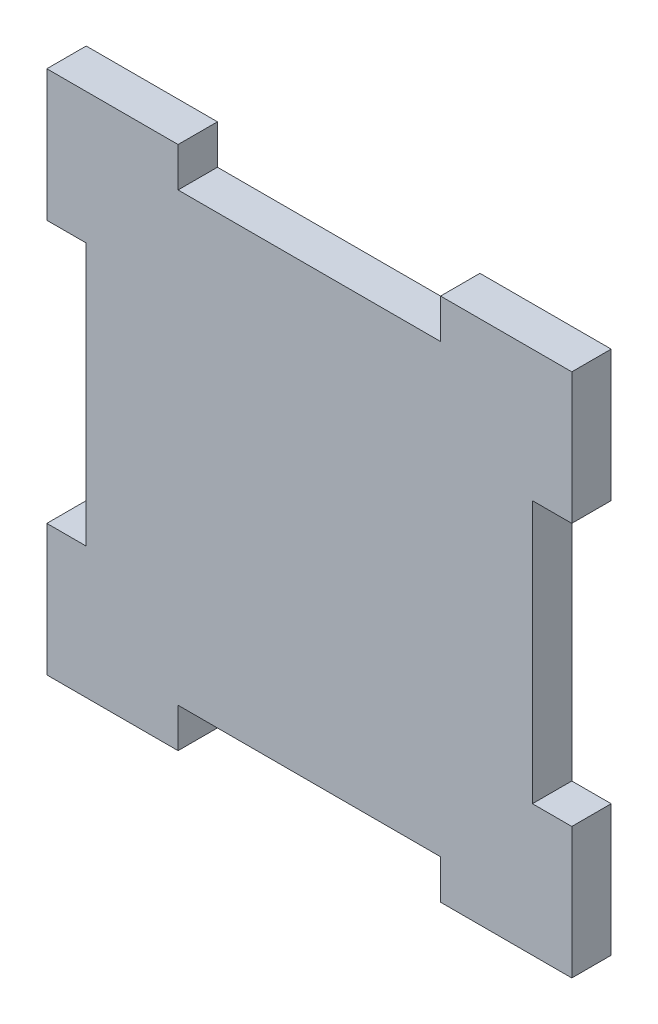
ISO-10303-21;
HEADER;
FILE_DESCRIPTION(('STEP AP214'),'2;1');
FILE_NAME('part.step','',(''),(''),'','','');
FILE_SCHEMA(('AUTOMOTIVE_DESIGN { 1 0 10303 214 1 1 1 1 }'));
ENDSEC;
DATA;
#1=APPLICATION_CONTEXT('core data for automotive mechanical design processes');
#2=APPLICATION_PROTOCOL_DEFINITION('international standard','automotive_design',2000,#1);
#3=PRODUCT_CONTEXT('',#1,'mechanical');
#4=PRODUCT('Part','Part','',(#3));
#5=PRODUCT_RELATED_PRODUCT_CATEGORY('part','',(#4));
#6=PRODUCT_DEFINITION_FORMATION('','',#4);
#7=PRODUCT_DEFINITION_CONTEXT('part definition',#1,'design');
#8=PRODUCT_DEFINITION('design','',#6,#7);
#9=PRODUCT_DEFINITION_SHAPE('','',#8);
#10=(LENGTH_UNIT() NAMED_UNIT(*) SI_UNIT(.MILLI.,.METRE.));
#11=(NAMED_UNIT(*) PLANE_ANGLE_UNIT() SI_UNIT($,.RADIAN.));
#12=(NAMED_UNIT(*) SI_UNIT($,.STERADIAN.) SOLID_ANGLE_UNIT());
#13=UNCERTAINTY_MEASURE_WITH_UNIT(LENGTH_MEASURE(1.E-05),#10,'distance_accuracy_value','');
#14=(GEOMETRIC_REPRESENTATION_CONTEXT(3) GLOBAL_UNCERTAINTY_ASSIGNED_CONTEXT((#13)) GLOBAL_UNIT_ASSIGNED_CONTEXT((#10,
#11,#12)) REPRESENTATION_CONTEXT('',''));
#15=CARTESIAN_POINT('',(0.,0.,0.));
#16=DIRECTION('',(0.,0.,1.));
#17=DIRECTION('',(1.,0.,0.));
#18=AXIS2_PLACEMENT_3D('',#15,#16,#17);
#19=CARTESIAN_POINT('',(-52.4406932856312,-32.8974736208199,3.));
#20=DIRECTION('',(1.,0.,0.));
#21=DIRECTION('',(0.,0.,-1.));
#22=AXIS2_PLACEMENT_3D('',#19,#20,#21);
#23=PLANE('',#22);
#24=DIRECTION('',(0.,-1.,0.));
#25=VECTOR('',#24,1.);
#26=CARTESIAN_POINT('',(-52.4406932856312,-32.8974736208199,0.));
#27=LINE('',#26,#25);
#28=CARTESIAN_POINT('',(-52.4406932856312,-22.8974736208199,0.));
#29=VERTEX_POINT('',#28);
#30=CARTESIAN_POINT('',(-52.4406932856312,-32.8974736208199,0.));
#31=VERTEX_POINT('',#30);
#32=EDGE_CURVE('E205',#29,#31,#27,.T.);
#33=ORIENTED_EDGE('',*,*,#32,.T.);
#34=DIRECTION('',(0.,0.,-1.));
#35=VECTOR('',#34,1.);
#36=CARTESIAN_POINT('',(-52.4406932856312,-32.8974736208199,3.));
#37=LINE('',#36,#35);
#38=CARTESIAN_POINT('',(-52.4406932856312,-32.8974736208199,3.));
#39=VERTEX_POINT('',#38);
#40=EDGE_CURVE('E11',#39,#31,#37,.T.);
#41=ORIENTED_EDGE('',*,*,#40,.F.);
#42=DIRECTION('',(0.,-1.,0.));
#43=VECTOR('',#42,1.);
#44=CARTESIAN_POINT('',(-52.4406932856312,-32.8974736208199,3.));
#45=LINE('',#44,#43);
#46=CARTESIAN_POINT('',(-52.4406932856312,-22.8974736208199,3.));
#47=VERTEX_POINT('',#46);
#48=EDGE_CURVE('E243',#47,#39,#45,.T.);
#49=ORIENTED_EDGE('',*,*,#48,.F.);
#50=DIRECTION('',(0.,0.,-1.));
#51=VECTOR('',#50,1.);
#52=CARTESIAN_POINT('',(-52.4406932856312,-22.8974736208199,3.));
#53=LINE('',#52,#51);
#54=EDGE_CURVE('E201',#47,#29,#53,.T.);
#55=ORIENTED_EDGE('',*,*,#54,.T.);
#56=EDGE_LOOP('',(#33,#41,#49,#55));
#57=FACE_BOUND('',#56,.T.);
#58=ADVANCED_FACE('F37',(#57),#23,.F.);
#59=CARTESIAN_POINT('',(-52.4406932856312,-32.8974736208199,3.));
#60=DIRECTION('',(0.,1.,0.));
#61=DIRECTION('',(0.,0.,1.));
#62=AXIS2_PLACEMENT_3D('',#59,#60,#61);
#63=PLANE('',#62);
#64=DIRECTION('',(1.,0.,0.));
#65=VECTOR('',#64,1.);
#66=CARTESIAN_POINT('',(-52.4406932856312,-32.8974736208199,0.));
#67=LINE('',#66,#65);
#68=CARTESIAN_POINT('',(-49.4406932856311,-32.8974736208199,0.));
#69=VERTEX_POINT('',#68);
#70=EDGE_CURVE('E208',#31,#69,#67,.T.);
#71=ORIENTED_EDGE('',*,*,#70,.T.);
#72=DIRECTION('',(0.,0.,-1.));
#73=VECTOR('',#72,1.);
#74=CARTESIAN_POINT('',(-49.4406932856311,-32.8974736208199,3.));
#75=LINE('',#74,#73);
#76=CARTESIAN_POINT('',(-49.4406932856311,-32.8974736208199,3.));
#77=VERTEX_POINT('',#76);
#78=EDGE_CURVE('E45',#77,#69,#75,.T.);
#79=ORIENTED_EDGE('',*,*,#78,.F.);
#80=DIRECTION('',(1.,0.,0.));
#81=VECTOR('',#80,1.);
#82=CARTESIAN_POINT('',(-52.4406932856312,-32.8974736208199,3.));
#83=LINE('',#82,#81);
#84=EDGE_CURVE('E132',#39,#77,#83,.T.);
#85=ORIENTED_EDGE('',*,*,#84,.F.);
#86=ORIENTED_EDGE('',*,*,#40,.T.);
#87=EDGE_LOOP('',(#71,#79,#85,#86));
#88=FACE_BOUND('',#87,.T.);
#89=ADVANCED_FACE('F361',(#88),#63,.F.);
#90=CARTESIAN_POINT('',(-49.4406932856311,-32.8974736208199,3.));
#91=DIRECTION('',(1.,0.,0.));
#92=DIRECTION('',(0.,0.,-1.));
#93=AXIS2_PLACEMENT_3D('',#90,#91,#92);
#94=PLANE('',#93);
#95=DIRECTION('',(0.,-1.,0.));
#96=VECTOR('',#95,1.);
#97=CARTESIAN_POINT('',(-49.4406932856311,-32.8974736208199,0.));
#98=LINE('',#97,#96);
#99=CARTESIAN_POINT('',(-49.4406932856311,-52.8974736208199,0.));
#100=VERTEX_POINT('',#99);
#101=EDGE_CURVE('E210',#69,#100,#98,.T.);
#102=ORIENTED_EDGE('',*,*,#101,.T.);
#103=DIRECTION('',(0.,0.,-1.));
#104=VECTOR('',#103,1.);
#105=CARTESIAN_POINT('',(-49.4406932856311,-52.8974736208199,3.));
#106=LINE('',#105,#104);
#107=CARTESIAN_POINT('',(-49.4406932856311,-52.8974736208199,3.));
#108=VERTEX_POINT('',#107);
#109=EDGE_CURVE('E286',#108,#100,#106,.T.);
#110=ORIENTED_EDGE('',*,*,#109,.F.);
#111=DIRECTION('',(0.,-1.,0.));
#112=VECTOR('',#111,1.);
#113=CARTESIAN_POINT('',(-49.4406932856311,-32.8974736208199,3.));
#114=LINE('',#113,#112);
#115=EDGE_CURVE('E294',#77,#108,#114,.T.);
#116=ORIENTED_EDGE('',*,*,#115,.F.);
#117=ORIENTED_EDGE('',*,*,#78,.T.);
#118=EDGE_LOOP('',(#102,#110,#116,#117));
#119=FACE_BOUND('',#118,.T.);
#120=ADVANCED_FACE('F292',(#119),#94,.F.);
#121=CARTESIAN_POINT('',(-52.4406932856312,-52.8974736208199,3.));
#122=DIRECTION('',(0.,-1.,0.));
#123=DIRECTION('',(0.,0.,-1.));
#124=AXIS2_PLACEMENT_3D('',#121,#122,#123);
#125=PLANE('',#124);
#126=DIRECTION('',(-1.,0.,0.));
#127=VECTOR('',#126,1.);
#128=CARTESIAN_POINT('',(-52.4406932856312,-52.8974736208199,0.));
#129=LINE('',#128,#127);
#130=CARTESIAN_POINT('',(-52.4406932856312,-52.8974736208199,0.));
#131=VERTEX_POINT('',#130);
#132=EDGE_CURVE('E212',#100,#131,#129,.T.);
#133=ORIENTED_EDGE('',*,*,#132,.T.);
#134=DIRECTION('',(0.,0.,-1.));
#135=VECTOR('',#134,1.);
#136=CARTESIAN_POINT('',(-52.4406932856312,-52.8974736208199,3.));
#137=LINE('',#136,#135);
#138=CARTESIAN_POINT('',(-52.4406932856312,-52.8974736208199,3.));
#139=VERTEX_POINT('',#138);
#140=EDGE_CURVE('E283',#139,#131,#137,.T.);
#141=ORIENTED_EDGE('',*,*,#140,.F.);
#142=DIRECTION('',(-1.,0.,0.));
#143=VECTOR('',#142,1.);
#144=CARTESIAN_POINT('',(-52.4406932856312,-52.8974736208199,3.));
#145=LINE('',#144,#143);
#146=EDGE_CURVE('E312',#108,#139,#145,.T.);
#147=ORIENTED_EDGE('',*,*,#146,.F.);
#148=ORIENTED_EDGE('',*,*,#109,.T.);
#149=EDGE_LOOP('',(#133,#141,#147,#148));
#150=FACE_BOUND('',#149,.T.);
#151=ADVANCED_FACE('F303',(#150),#125,.F.);
#152=CARTESIAN_POINT('',(-52.4406932856312,-52.8974736208199,3.));
#153=DIRECTION('',(1.,0.,0.));
#154=DIRECTION('',(0.,1.,0.));
#155=AXIS2_PLACEMENT_3D('',#152,#153,#154);
#156=PLANE('',#155);
#157=DIRECTION('',(0.,-1.,0.));
#158=VECTOR('',#157,1.);
#159=CARTESIAN_POINT('',(-52.4406932856312,-52.8974736208199,0.));
#160=LINE('',#159,#158);
#161=CARTESIAN_POINT('',(-52.4406932856311,-62.8974736208199,0.));
#162=VERTEX_POINT('',#161);
#163=EDGE_CURVE('E214',#131,#162,#160,.T.);
#164=ORIENTED_EDGE('',*,*,#163,.T.);
#165=DIRECTION('',(0.,0.,-1.));
#166=VECTOR('',#165,1.);
#167=CARTESIAN_POINT('',(-52.4406932856311,-62.8974736208199,3.));
#168=LINE('',#167,#166);
#169=CARTESIAN_POINT('',(-52.4406932856311,-62.8974736208199,3.));
#170=VERTEX_POINT('',#169);
#171=EDGE_CURVE('E280',#170,#162,#168,.T.);
#172=ORIENTED_EDGE('',*,*,#171,.F.);
#173=DIRECTION('',(0.,-1.,0.));
#174=VECTOR('',#173,1.);
#175=CARTESIAN_POINT('',(-52.4406932856312,-52.8974736208199,3.));
#176=LINE('',#175,#174);
#177=EDGE_CURVE('E309',#139,#170,#176,.T.);
#178=ORIENTED_EDGE('',*,*,#177,.F.);
#179=ORIENTED_EDGE('',*,*,#140,.T.);
#180=EDGE_LOOP('',(#164,#172,#178,#179));
#181=FACE_BOUND('',#180,.T.);
#182=ADVANCED_FACE('F307',(#181),#156,.F.);
#183=CARTESIAN_POINT('',(-42.4406932856312,-62.8974736208199,3.));
#184=DIRECTION('',(0.,1.,0.));
#185=DIRECTION('',(0.,0.,1.));
#186=AXIS2_PLACEMENT_3D('',#183,#184,#185);
#187=PLANE('',#186);
#188=DIRECTION('',(1.,0.,0.));
#189=VECTOR('',#188,1.);
#190=CARTESIAN_POINT('',(-42.4406932856312,-62.8974736208199,0.));
#191=LINE('',#190,#189);
#192=CARTESIAN_POINT('',(-42.4406932856312,-62.8974736208199,0.));
#193=VERTEX_POINT('',#192);
#194=EDGE_CURVE('E216',#162,#193,#191,.T.);
#195=ORIENTED_EDGE('',*,*,#194,.T.);
#196=DIRECTION('',(0.,0.,-1.));
#197=VECTOR('',#196,1.);
#198=CARTESIAN_POINT('',(-42.4406932856312,-62.8974736208199,3.));
#199=LINE('',#198,#197);
#200=CARTESIAN_POINT('',(-42.4406932856312,-62.8974736208199,3.));
#201=VERTEX_POINT('',#200);
#202=EDGE_CURVE('E277',#201,#193,#199,.T.);
#203=ORIENTED_EDGE('',*,*,#202,.F.);
#204=DIRECTION('',(1.,0.,0.));
#205=VECTOR('',#204,1.);
#206=CARTESIAN_POINT('',(-42.4406932856312,-62.8974736208199,3.));
#207=LINE('',#206,#205);
#208=EDGE_CURVE('E311',#170,#201,#207,.T.);
#209=ORIENTED_EDGE('',*,*,#208,.F.);
#210=ORIENTED_EDGE('',*,*,#171,.T.);
#211=EDGE_LOOP('',(#195,#203,#209,#210));
#212=FACE_BOUND('',#211,.T.);
#213=ADVANCED_FACE('F374',(#212),#187,.F.);
#214=CARTESIAN_POINT('',(-42.4406932856312,-62.8974736208199,3.));
#215=DIRECTION('',(-1.,0.,0.));
#216=DIRECTION('',(0.,0.,1.));
#217=AXIS2_PLACEMENT_3D('',#214,#215,#216);
#218=PLANE('',#217);
#219=DIRECTION('',(0.,1.,0.));
#220=VECTOR('',#219,1.);
#221=CARTESIAN_POINT('',(-42.4406932856312,-62.8974736208199,0.));
#222=LINE('',#221,#220);
#223=CARTESIAN_POINT('',(-42.4406932856312,-59.8974736208199,0.));
#224=VERTEX_POINT('',#223);
#225=EDGE_CURVE('E218',#193,#224,#222,.T.);
#226=ORIENTED_EDGE('',*,*,#225,.T.);
#227=DIRECTION('',(0.,0.,-1.));
#228=VECTOR('',#227,1.);
#229=CARTESIAN_POINT('',(-42.4406932856312,-59.8974736208199,3.));
#230=LINE('',#229,#228);
#231=CARTESIAN_POINT('',(-42.4406932856312,-59.8974736208199,3.));
#232=VERTEX_POINT('',#231);
#233=EDGE_CURVE('E274',#232,#224,#230,.T.);
#234=ORIENTED_EDGE('',*,*,#233,.F.);
#235=DIRECTION('',(0.,1.,0.));
#236=VECTOR('',#235,1.);
#237=CARTESIAN_POINT('',(-42.4406932856312,-62.8974736208199,3.));
#238=LINE('',#237,#236);
#239=EDGE_CURVE('E314',#201,#232,#238,.T.);
#240=ORIENTED_EDGE('',*,*,#239,.F.);
#241=ORIENTED_EDGE('',*,*,#202,.T.);
#242=EDGE_LOOP('',(#226,#234,#240,#241));
#243=FACE_BOUND('',#242,.T.);
#244=ADVANCED_FACE('F377',(#243),#218,.F.);
#245=CARTESIAN_POINT('',(-42.4406932856312,-59.8974736208199,3.));
#246=DIRECTION('',(0.,1.,0.));
#247=DIRECTION('',(0.,0.,1.));
#248=AXIS2_PLACEMENT_3D('',#245,#246,#247);
#249=PLANE('',#248);
#250=DIRECTION('',(1.,0.,0.));
#251=VECTOR('',#250,1.);
#252=CARTESIAN_POINT('',(-42.4406932856312,-59.8974736208199,0.));
#253=LINE('',#252,#251);
#254=CARTESIAN_POINT('',(-22.4406932856312,-59.8974736208199,0.));
#255=VERTEX_POINT('',#254);
#256=EDGE_CURVE('E220',#224,#255,#253,.T.);
#257=ORIENTED_EDGE('',*,*,#256,.T.);
#258=DIRECTION('',(0.,0.,-1.));
#259=VECTOR('',#258,1.);
#260=CARTESIAN_POINT('',(-22.4406932856312,-59.8974736208199,3.));
#261=LINE('',#260,#259);
#262=CARTESIAN_POINT('',(-22.4406932856312,-59.8974736208199,3.));
#263=VERTEX_POINT('',#262);
#264=EDGE_CURVE('E271',#263,#255,#261,.T.);
#265=ORIENTED_EDGE('',*,*,#264,.F.);
#266=DIRECTION('',(1.,0.,0.));
#267=VECTOR('',#266,1.);
#268=CARTESIAN_POINT('',(-42.4406932856312,-59.8974736208199,3.));
#269=LINE('',#268,#267);
#270=EDGE_CURVE('E320',#232,#263,#269,.T.);
#271=ORIENTED_EDGE('',*,*,#270,.F.);
#272=ORIENTED_EDGE('',*,*,#233,.T.);
#273=EDGE_LOOP('',(#257,#265,#271,#272));
#274=FACE_BOUND('',#273,.T.);
#275=ADVANCED_FACE('F381',(#274),#249,.F.);
#276=CARTESIAN_POINT('',(-22.4406932856312,-62.8974736208199,3.));
#277=DIRECTION('',(1.,0.,0.));
#278=DIRECTION('',(0.,0.,-1.));
#279=AXIS2_PLACEMENT_3D('',#276,#277,#278);
#280=PLANE('',#279);
#281=DIRECTION('',(0.,-1.,0.));
#282=VECTOR('',#281,1.);
#283=CARTESIAN_POINT('',(-22.4406932856312,-62.8974736208199,0.));
#284=LINE('',#283,#282);
#285=CARTESIAN_POINT('',(-22.4406932856312,-62.8974736208199,0.));
#286=VERTEX_POINT('',#285);
#287=EDGE_CURVE('E222',#255,#286,#284,.T.);
#288=ORIENTED_EDGE('',*,*,#287,.T.);
#289=DIRECTION('',(0.,0.,-1.));
#290=VECTOR('',#289,1.);
#291=CARTESIAN_POINT('',(-22.4406932856312,-62.8974736208199,3.));
#292=LINE('',#291,#290);
#293=CARTESIAN_POINT('',(-22.4406932856312,-62.8974736208199,3.));
#294=VERTEX_POINT('',#293);
#295=EDGE_CURVE('E268',#294,#286,#292,.T.);
#296=ORIENTED_EDGE('',*,*,#295,.F.);
#297=DIRECTION('',(0.,-1.,0.));
#298=VECTOR('',#297,1.);
#299=CARTESIAN_POINT('',(-22.4406932856312,-62.8974736208199,3.));
#300=LINE('',#299,#298);
#301=EDGE_CURVE('E322',#263,#294,#300,.T.);
#302=ORIENTED_EDGE('',*,*,#301,.F.);
#303=ORIENTED_EDGE('',*,*,#264,.T.);
#304=EDGE_LOOP('',(#288,#296,#302,#303));
#305=FACE_BOUND('',#304,.T.);
#306=ADVANCED_FACE('F385',(#305),#280,.F.);
#307=CARTESIAN_POINT('',(-22.4406932856312,-62.8974736208199,3.));
#308=DIRECTION('',(0.,1.,0.));
#309=DIRECTION('',(0.,0.,1.));
#310=AXIS2_PLACEMENT_3D('',#307,#308,#309);
#311=PLANE('',#310);
#312=DIRECTION('',(1.,0.,0.));
#313=VECTOR('',#312,1.);
#314=CARTESIAN_POINT('',(-22.4406932856312,-62.8974736208199,0.));
#315=LINE('',#314,#313);
#316=CARTESIAN_POINT('',(-12.4406932856311,-62.8974736208199,0.));
#317=VERTEX_POINT('',#316);
#318=EDGE_CURVE('E224',#286,#317,#315,.T.);
#319=ORIENTED_EDGE('',*,*,#318,.T.);
#320=DIRECTION('',(0.,0.,-1.));
#321=VECTOR('',#320,1.);
#322=CARTESIAN_POINT('',(-12.4406932856311,-62.8974736208199,3.));
#323=LINE('',#322,#321);
#324=CARTESIAN_POINT('',(-12.4406932856311,-62.8974736208199,3.));
#325=VERTEX_POINT('',#324);
#326=EDGE_CURVE('E265',#325,#317,#323,.T.);
#327=ORIENTED_EDGE('',*,*,#326,.F.);
#328=DIRECTION('',(1.,0.,0.));
#329=VECTOR('',#328,1.);
#330=CARTESIAN_POINT('',(-22.4406932856312,-62.8974736208199,3.));
#331=LINE('',#330,#329);
#332=EDGE_CURVE('E324',#294,#325,#331,.T.);
#333=ORIENTED_EDGE('',*,*,#332,.F.);
#334=ORIENTED_EDGE('',*,*,#295,.T.);
#335=EDGE_LOOP('',(#319,#327,#333,#334));
#336=FACE_BOUND('',#335,.T.);
#337=ADVANCED_FACE('F389',(#336),#311,.F.);
#338=CARTESIAN_POINT('',(-12.4406932856311,-52.8974736208199,3.));
#339=DIRECTION('',(-1.,0.,0.));
#340=DIRECTION('',(0.,0.,1.));
#341=AXIS2_PLACEMENT_3D('',#338,#339,#340);
#342=PLANE('',#341);
#343=DIRECTION('',(0.,1.,0.));
#344=VECTOR('',#343,1.);
#345=CARTESIAN_POINT('',(-12.4406932856311,-52.8974736208199,0.));
#346=LINE('',#345,#344);
#347=CARTESIAN_POINT('',(-12.4406932856311,-52.8974736208199,0.));
#348=VERTEX_POINT('',#347);
#349=EDGE_CURVE('E226',#317,#348,#346,.T.);
#350=ORIENTED_EDGE('',*,*,#349,.T.);
#351=DIRECTION('',(0.,0.,-1.));
#352=VECTOR('',#351,1.);
#353=CARTESIAN_POINT('',(-12.4406932856311,-52.8974736208199,3.));
#354=LINE('',#353,#352);
#355=CARTESIAN_POINT('',(-12.4406932856311,-52.8974736208199,3.));
#356=VERTEX_POINT('',#355);
#357=EDGE_CURVE('E262',#356,#348,#354,.T.);
#358=ORIENTED_EDGE('',*,*,#357,.F.);
#359=DIRECTION('',(0.,1.,0.));
#360=VECTOR('',#359,1.);
#361=CARTESIAN_POINT('',(-12.4406932856311,-52.8974736208199,3.));
#362=LINE('',#361,#360);
#363=EDGE_CURVE('E326',#325,#356,#362,.T.);
#364=ORIENTED_EDGE('',*,*,#363,.F.);
#365=ORIENTED_EDGE('',*,*,#326,.T.);
#366=EDGE_LOOP('',(#350,#358,#364,#365));
#367=FACE_BOUND('',#366,.T.);
#368=ADVANCED_FACE('F393',(#367),#342,.F.);
#369=CARTESIAN_POINT('',(-12.4406932856311,-52.8974736208199,3.));
#370=DIRECTION('',(0.,-1.,0.));
#371=DIRECTION('',(0.,0.,-1.));
#372=AXIS2_PLACEMENT_3D('',#369,#370,#371);
#373=PLANE('',#372);
#374=DIRECTION('',(-1.,0.,0.));
#375=VECTOR('',#374,1.);
#376=CARTESIAN_POINT('',(-12.4406932856311,-52.8974736208199,0.));
#377=LINE('',#376,#375);
#378=CARTESIAN_POINT('',(-15.4406932856311,-52.8974736208199,0.));
#379=VERTEX_POINT('',#378);
#380=EDGE_CURVE('E228',#348,#379,#377,.T.);
#381=ORIENTED_EDGE('',*,*,#380,.T.);
#382=DIRECTION('',(0.,0.,-1.));
#383=VECTOR('',#382,1.);
#384=CARTESIAN_POINT('',(-15.4406932856311,-52.8974736208199,3.));
#385=LINE('',#384,#383);
#386=CARTESIAN_POINT('',(-15.4406932856311,-52.8974736208199,3.));
#387=VERTEX_POINT('',#386);
#388=EDGE_CURVE('E259',#387,#379,#385,.T.);
#389=ORIENTED_EDGE('',*,*,#388,.F.);
#390=DIRECTION('',(-1.,0.,0.));
#391=VECTOR('',#390,1.);
#392=CARTESIAN_POINT('',(-12.4406932856311,-52.8974736208199,3.));
#393=LINE('',#392,#391);
#394=EDGE_CURVE('E328',#356,#387,#393,.T.);
#395=ORIENTED_EDGE('',*,*,#394,.F.);
#396=ORIENTED_EDGE('',*,*,#357,.T.);
#397=EDGE_LOOP('',(#381,#389,#395,#396));
#398=FACE_BOUND('',#397,.T.);
#399=ADVANCED_FACE('F397',(#398),#373,.F.);
#400=CARTESIAN_POINT('',(-15.4406932856311,-32.8974736208199,3.));
#401=DIRECTION('',(-1.,0.,0.));
#402=DIRECTION('',(0.,0.,1.));
#403=AXIS2_PLACEMENT_3D('',#400,#401,#402);
#404=PLANE('',#403);
#405=DIRECTION('',(0.,1.,0.));
#406=VECTOR('',#405,1.);
#407=CARTESIAN_POINT('',(-15.4406932856311,-32.8974736208199,0.));
#408=LINE('',#407,#406);
#409=CARTESIAN_POINT('',(-15.4406932856311,-32.8974736208199,0.));
#410=VERTEX_POINT('',#409);
#411=EDGE_CURVE('E230',#379,#410,#408,.T.);
#412=ORIENTED_EDGE('',*,*,#411,.T.);
#413=DIRECTION('',(0.,0.,-1.));
#414=VECTOR('',#413,1.);
#415=CARTESIAN_POINT('',(-15.4406932856311,-32.8974736208199,3.));
#416=LINE('',#415,#414);
#417=CARTESIAN_POINT('',(-15.4406932856311,-32.8974736208199,3.));
#418=VERTEX_POINT('',#417);
#419=EDGE_CURVE('E256',#418,#410,#416,.T.);
#420=ORIENTED_EDGE('',*,*,#419,.F.);
#421=DIRECTION('',(0.,1.,0.));
#422=VECTOR('',#421,1.);
#423=CARTESIAN_POINT('',(-15.4406932856311,-32.8974736208199,3.));
#424=LINE('',#423,#422);
#425=EDGE_CURVE('E330',#387,#418,#424,.T.);
#426=ORIENTED_EDGE('',*,*,#425,.F.);
#427=ORIENTED_EDGE('',*,*,#388,.T.);
#428=EDGE_LOOP('',(#412,#420,#426,#427));
#429=FACE_BOUND('',#428,.T.);
#430=ADVANCED_FACE('F401',(#429),#404,.F.);
#431=CARTESIAN_POINT('',(-12.4406932856311,-32.8974736208199,3.));
#432=DIRECTION('',(0.,1.,0.));
#433=DIRECTION('',(0.,0.,1.));
#434=AXIS2_PLACEMENT_3D('',#431,#432,#433);
#435=PLANE('',#434);
#436=DIRECTION('',(1.,0.,0.));
#437=VECTOR('',#436,1.);
#438=CARTESIAN_POINT('',(-12.4406932856311,-32.8974736208199,0.));
#439=LINE('',#438,#437);
#440=CARTESIAN_POINT('',(-12.4406932856311,-32.8974736208199,0.));
#441=VERTEX_POINT('',#440);
#442=EDGE_CURVE('E232',#410,#441,#439,.T.);
#443=ORIENTED_EDGE('',*,*,#442,.T.);
#444=DIRECTION('',(0.,0.,-1.));
#445=VECTOR('',#444,1.);
#446=CARTESIAN_POINT('',(-12.4406932856311,-32.8974736208199,3.));
#447=LINE('',#446,#445);
#448=CARTESIAN_POINT('',(-12.4406932856311,-32.8974736208199,3.));
#449=VERTEX_POINT('',#448);
#450=EDGE_CURVE('E253',#449,#441,#447,.T.);
#451=ORIENTED_EDGE('',*,*,#450,.F.);
#452=DIRECTION('',(1.,0.,0.));
#453=VECTOR('',#452,1.);
#454=CARTESIAN_POINT('',(-12.4406932856311,-32.8974736208199,3.));
#455=LINE('',#454,#453);
#456=EDGE_CURVE('E332',#418,#449,#455,.T.);
#457=ORIENTED_EDGE('',*,*,#456,.F.);
#458=ORIENTED_EDGE('',*,*,#419,.T.);
#459=EDGE_LOOP('',(#443,#451,#457,#458));
#460=FACE_BOUND('',#459,.T.);
#461=ADVANCED_FACE('F405',(#460),#435,.F.);
#462=CARTESIAN_POINT('',(-12.4406932856311,-32.8974736208199,3.));
#463=DIRECTION('',(-1.,0.,0.));
#464=DIRECTION('',(0.,-1.,0.));
#465=AXIS2_PLACEMENT_3D('',#462,#463,#464);
#466=PLANE('',#465);
#467=DIRECTION('',(0.,1.,0.));
#468=VECTOR('',#467,1.);
#469=CARTESIAN_POINT('',(-12.4406932856311,-32.8974736208199,0.));
#470=LINE('',#469,#468);
#471=CARTESIAN_POINT('',(-12.4406932856311,-22.8974736208199,0.));
#472=VERTEX_POINT('',#471);
#473=EDGE_CURVE('E234',#441,#472,#470,.T.);
#474=ORIENTED_EDGE('',*,*,#473,.T.);
#475=DIRECTION('',(0.,0.,-1.));
#476=VECTOR('',#475,1.);
#477=CARTESIAN_POINT('',(-12.4406932856311,-22.8974736208199,3.));
#478=LINE('',#477,#476);
#479=CARTESIAN_POINT('',(-12.4406932856311,-22.8974736208199,3.));
#480=VERTEX_POINT('',#479);
#481=EDGE_CURVE('E250',#480,#472,#478,.T.);
#482=ORIENTED_EDGE('',*,*,#481,.F.);
#483=DIRECTION('',(0.,1.,0.));
#484=VECTOR('',#483,1.);
#485=CARTESIAN_POINT('',(-12.4406932856311,-32.8974736208199,3.));
#486=LINE('',#485,#484);
#487=EDGE_CURVE('E334',#449,#480,#486,.T.);
#488=ORIENTED_EDGE('',*,*,#487,.F.);
#489=ORIENTED_EDGE('',*,*,#450,.T.);
#490=EDGE_LOOP('',(#474,#482,#488,#489));
#491=FACE_BOUND('',#490,.T.);
#492=ADVANCED_FACE('F409',(#491),#466,.F.);
#493=CARTESIAN_POINT('',(-22.4406932856312,-22.8974736208199,3.));
#494=DIRECTION('',(0.,-1.,0.));
#495=DIRECTION('',(0.,0.,-1.));
#496=AXIS2_PLACEMENT_3D('',#493,#494,#495);
#497=PLANE('',#496);
#498=DIRECTION('',(-1.,0.,0.));
#499=VECTOR('',#498,1.);
#500=CARTESIAN_POINT('',(-22.4406932856312,-22.8974736208199,0.));
#501=LINE('',#500,#499);
#502=CARTESIAN_POINT('',(-22.4406932856312,-22.8974736208199,0.));
#503=VERTEX_POINT('',#502);
#504=EDGE_CURVE('E236',#472,#503,#501,.T.);
#505=ORIENTED_EDGE('',*,*,#504,.T.);
#506=DIRECTION('',(0.,0.,-1.));
#507=VECTOR('',#506,1.);
#508=CARTESIAN_POINT('',(-22.4406932856312,-22.8974736208199,3.));
#509=LINE('',#508,#507);
#510=CARTESIAN_POINT('',(-22.4406932856312,-22.8974736208199,3.));
#511=VERTEX_POINT('',#510);
#512=EDGE_CURVE('E247',#511,#503,#509,.T.);
#513=ORIENTED_EDGE('',*,*,#512,.F.);
#514=DIRECTION('',(-1.,0.,0.));
#515=VECTOR('',#514,1.);
#516=CARTESIAN_POINT('',(-22.4406932856312,-22.8974736208199,3.));
#517=LINE('',#516,#515);
#518=EDGE_CURVE('E336',#480,#511,#517,.T.);
#519=ORIENTED_EDGE('',*,*,#518,.F.);
#520=ORIENTED_EDGE('',*,*,#481,.T.);
#521=EDGE_LOOP('',(#505,#513,#519,#520));
#522=FACE_BOUND('',#521,.T.);
#523=ADVANCED_FACE('F342',(#522),#497,.F.);
#524=CARTESIAN_POINT('',(-22.4406932856312,-22.8974736208199,3.));
#525=DIRECTION('',(1.,0.,0.));
#526=DIRECTION('',(0.,0.,-1.));
#527=AXIS2_PLACEMENT_3D('',#524,#525,#526);
#528=PLANE('',#527);
#529=DIRECTION('',(0.,-1.,0.));
#530=VECTOR('',#529,1.);
#531=CARTESIAN_POINT('',(-22.4406932856312,-22.8974736208199,0.));
#532=LINE('',#531,#530);
#533=CARTESIAN_POINT('',(-22.4406932856312,-25.8974736208199,0.));
#534=VERTEX_POINT('',#533);
#535=EDGE_CURVE('E238',#503,#534,#532,.T.);
#536=ORIENTED_EDGE('',*,*,#535,.T.);
#537=DIRECTION('',(0.,0.,-1.));
#538=VECTOR('',#537,1.);
#539=CARTESIAN_POINT('',(-22.4406932856312,-25.8974736208199,3.));
#540=LINE('',#539,#538);
#541=CARTESIAN_POINT('',(-22.4406932856312,-25.8974736208199,3.));
#542=VERTEX_POINT('',#541);
#543=EDGE_CURVE('E196',#542,#534,#540,.T.);
#544=ORIENTED_EDGE('',*,*,#543,.F.);
#545=DIRECTION('',(0.,-1.,0.));
#546=VECTOR('',#545,1.);
#547=CARTESIAN_POINT('',(-22.4406932856312,-22.8974736208199,3.));
#548=LINE('',#547,#546);
#549=EDGE_CURVE('E187',#511,#542,#548,.T.);
#550=ORIENTED_EDGE('',*,*,#549,.F.);
#551=ORIENTED_EDGE('',*,*,#512,.T.);
#552=EDGE_LOOP('',(#536,#544,#550,#551));
#553=FACE_BOUND('',#552,.T.);
#554=ADVANCED_FACE('F346',(#553),#528,.F.);
#555=CARTESIAN_POINT('',(-42.4406932856312,-25.8974736208199,3.));
#556=DIRECTION('',(0.,-1.,0.));
#557=DIRECTION('',(0.,0.,-1.));
#558=AXIS2_PLACEMENT_3D('',#555,#556,#557);
#559=PLANE('',#558);
#560=DIRECTION('',(-1.,0.,0.));
#561=VECTOR('',#560,1.);
#562=CARTESIAN_POINT('',(-42.4406932856312,-25.8974736208199,0.));
#563=LINE('',#562,#561);
#564=CARTESIAN_POINT('',(-42.4406932856312,-25.8974736208199,0.));
#565=VERTEX_POINT('',#564);
#566=EDGE_CURVE('E195',#534,#565,#563,.T.);
#567=ORIENTED_EDGE('',*,*,#566,.T.);
#568=DIRECTION('',(0.,0.,-1.));
#569=VECTOR('',#568,1.);
#570=CARTESIAN_POINT('',(-42.4406932856312,-25.8974736208199,3.));
#571=LINE('',#570,#569);
#572=CARTESIAN_POINT('',(-42.4406932856312,-25.8974736208199,3.));
#573=VERTEX_POINT('',#572);
#574=EDGE_CURVE('E192',#573,#565,#571,.T.);
#575=ORIENTED_EDGE('',*,*,#574,.F.);
#576=DIRECTION('',(-1.,0.,0.));
#577=VECTOR('',#576,1.);
#578=CARTESIAN_POINT('',(-42.4406932856312,-25.8974736208199,3.));
#579=LINE('',#578,#577);
#580=EDGE_CURVE('E181',#542,#573,#579,.T.);
#581=ORIENTED_EDGE('',*,*,#580,.F.);
#582=ORIENTED_EDGE('',*,*,#543,.T.);
#583=EDGE_LOOP('',(#567,#575,#581,#582));
#584=FACE_BOUND('',#583,.T.);
#585=ADVANCED_FACE('F193',(#584),#559,.F.);
#586=CARTESIAN_POINT('',(-42.4406932856312,-22.8974736208199,3.));
#587=DIRECTION('',(-1.,0.,0.));
#588=DIRECTION('',(0.,0.,1.));
#589=AXIS2_PLACEMENT_3D('',#586,#587,#588);
#590=PLANE('',#589);
#591=DIRECTION('',(0.,1.,0.));
#592=VECTOR('',#591,1.);
#593=CARTESIAN_POINT('',(-42.4406932856312,-22.8974736208199,0.));
#594=LINE('',#593,#592);
#595=CARTESIAN_POINT('',(-42.4406932856312,-22.8974736208199,0.));
#596=VERTEX_POINT('',#595);
#597=EDGE_CURVE('E118',#565,#596,#594,.T.);
#598=ORIENTED_EDGE('',*,*,#597,.T.);
#599=DIRECTION('',(0.,0.,-1.));
#600=VECTOR('',#599,1.);
#601=CARTESIAN_POINT('',(-42.4406932856312,-22.8974736208199,3.));
#602=LINE('',#601,#600);
#603=CARTESIAN_POINT('',(-42.4406932856312,-22.8974736208199,3.));
#604=VERTEX_POINT('',#603);
#605=EDGE_CURVE('E197',#604,#596,#602,.T.);
#606=ORIENTED_EDGE('',*,*,#605,.F.);
#607=DIRECTION('',(0.,1.,0.));
#608=VECTOR('',#607,1.);
#609=CARTESIAN_POINT('',(-42.4406932856312,-22.8974736208199,3.));
#610=LINE('',#609,#608);
#611=EDGE_CURVE('E185',#573,#604,#610,.T.);
#612=ORIENTED_EDGE('',*,*,#611,.F.);
#613=ORIENTED_EDGE('',*,*,#574,.T.);
#614=EDGE_LOOP('',(#598,#606,#612,#613));
#615=FACE_BOUND('',#614,.T.);
#616=ADVANCED_FACE('F199',(#615),#590,.F.);
#617=CARTESIAN_POINT('',(-42.4406932856312,-22.8974736208199,3.));
#618=DIRECTION('',(0.,-1.,0.));
#619=DIRECTION('',(0.,0.,-1.));
#620=AXIS2_PLACEMENT_3D('',#617,#618,#619);
#621=PLANE('',#620);
#622=DIRECTION('',(-1.,0.,0.));
#623=VECTOR('',#622,1.);
#624=CARTESIAN_POINT('',(-42.4406932856312,-22.8974736208199,0.));
#625=LINE('',#624,#623);
#626=EDGE_CURVE('E124',#596,#29,#625,.T.);
#627=ORIENTED_EDGE('',*,*,#626,.T.);
#628=ORIENTED_EDGE('',*,*,#54,.F.);
#629=DIRECTION('',(-1.,0.,0.));
#630=VECTOR('',#629,1.);
#631=CARTESIAN_POINT('',(-42.4406932856312,-22.8974736208199,3.));
#632=LINE('',#631,#630);
#633=EDGE_CURVE('E53',#604,#47,#632,.T.);
#634=ORIENTED_EDGE('',*,*,#633,.F.);
#635=ORIENTED_EDGE('',*,*,#605,.T.);
#636=EDGE_LOOP('',(#627,#628,#634,#635));
#637=FACE_BOUND('',#636,.T.);
#638=ADVANCED_FACE('F350',(#637),#621,.F.);
#639=CARTESIAN_POINT('',(0.,0.,3.));
#640=DIRECTION('',(0.,0.,1.));
#641=DIRECTION('',(1.,0.,0.));
#642=AXIS2_PLACEMENT_3D('',#639,#640,#641);
#643=PLANE('',#642);
#644=ORIENTED_EDGE('',*,*,#48,.T.);
#645=ORIENTED_EDGE('',*,*,#84,.T.);
#646=ORIENTED_EDGE('',*,*,#115,.T.);
#647=ORIENTED_EDGE('',*,*,#146,.T.);
#648=ORIENTED_EDGE('',*,*,#177,.T.);
#649=ORIENTED_EDGE('',*,*,#208,.T.);
#650=ORIENTED_EDGE('',*,*,#239,.T.);
#651=ORIENTED_EDGE('',*,*,#270,.T.);
#652=ORIENTED_EDGE('',*,*,#301,.T.);
#653=ORIENTED_EDGE('',*,*,#332,.T.);
#654=ORIENTED_EDGE('',*,*,#363,.T.);
#655=ORIENTED_EDGE('',*,*,#394,.T.);
#656=ORIENTED_EDGE('',*,*,#425,.T.);
#657=ORIENTED_EDGE('',*,*,#456,.T.);
#658=ORIENTED_EDGE('',*,*,#487,.T.);
#659=ORIENTED_EDGE('',*,*,#518,.T.);
#660=ORIENTED_EDGE('',*,*,#549,.T.);
#661=ORIENTED_EDGE('',*,*,#580,.T.);
#662=ORIENTED_EDGE('',*,*,#611,.T.);
#663=ORIENTED_EDGE('',*,*,#633,.T.);
#664=EDGE_LOOP('',(#644,#645,#646,#647,#648,#649,#650,#651,#652,#653,#654,#655,#656,#657,#658,
#659,#660,#661,#662,#663));
#665=FACE_BOUND('',#664,.T.);
#666=ADVANCED_FACE('F183',(#665),#643,.T.);
#667=CARTESIAN_POINT('',(0.,0.,0.));
#668=DIRECTION('',(0.,0.,1.));
#669=DIRECTION('',(1.,0.,0.));
#670=AXIS2_PLACEMENT_3D('',#667,#668,#669);
#671=PLANE('',#670);
#672=ORIENTED_EDGE('',*,*,#32,.F.);
#673=ORIENTED_EDGE('',*,*,#626,.F.);
#674=ORIENTED_EDGE('',*,*,#597,.F.);
#675=ORIENTED_EDGE('',*,*,#566,.F.);
#676=ORIENTED_EDGE('',*,*,#535,.F.);
#677=ORIENTED_EDGE('',*,*,#504,.F.);
#678=ORIENTED_EDGE('',*,*,#473,.F.);
#679=ORIENTED_EDGE('',*,*,#442,.F.);
#680=ORIENTED_EDGE('',*,*,#411,.F.);
#681=ORIENTED_EDGE('',*,*,#380,.F.);
#682=ORIENTED_EDGE('',*,*,#349,.F.);
#683=ORIENTED_EDGE('',*,*,#318,.F.);
#684=ORIENTED_EDGE('',*,*,#287,.F.);
#685=ORIENTED_EDGE('',*,*,#256,.F.);
#686=ORIENTED_EDGE('',*,*,#225,.F.);
#687=ORIENTED_EDGE('',*,*,#194,.F.);
#688=ORIENTED_EDGE('',*,*,#163,.F.);
#689=ORIENTED_EDGE('',*,*,#132,.F.);
#690=ORIENTED_EDGE('',*,*,#101,.F.);
#691=ORIENTED_EDGE('',*,*,#70,.F.);
#692=EDGE_LOOP('',(#672,#673,#674,#675,#676,#677,#678,#679,#680,#681,#682,#683,#684,#685,#686,
#687,#688,#689,#690,#691));
#693=FACE_BOUND('',#692,.T.);
#694=ADVANCED_FACE('F298',(#693),#671,.F.);
#695=CLOSED_SHELL('',(#58,#89,#120,#151,#182,#213,#244,#275,#306,#337,#368,#399,#430,#461,#492,
#523,#554,#585,#616,#638,#666,#694));
#696=MANIFOLD_SOLID_BREP('B2',#695);
#697=ADVANCED_BREP_SHAPE_REPRESENTATION('',(#18,#696),#14);
#698=SHAPE_DEFINITION_REPRESENTATION(#9,#697);
ENDSEC;
END-ISO-10303-21;
